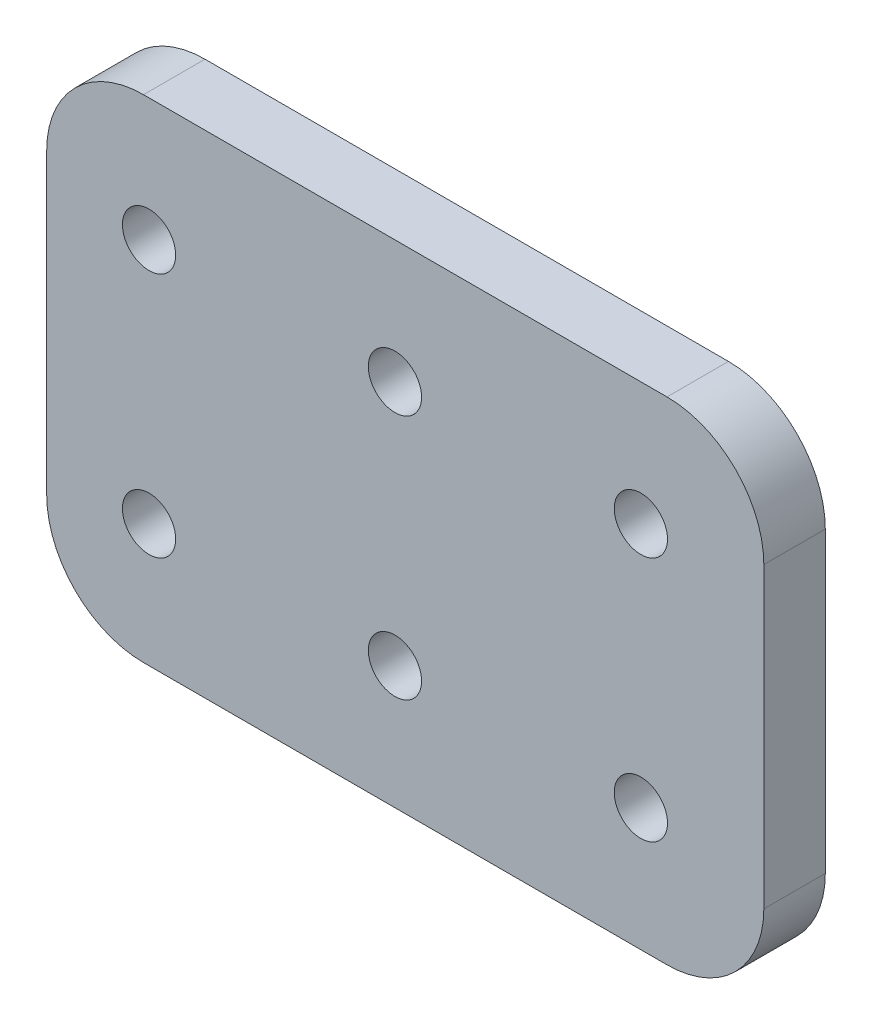
ISO-10303-21;
HEADER;
FILE_DESCRIPTION(('STEP AP214'),'2;1');
FILE_NAME('part.step','',(''),(''),'','','');
FILE_SCHEMA(('AUTOMOTIVE_DESIGN { 1 0 10303 214 1 1 1 1 }'));
ENDSEC;
DATA;
#1=APPLICATION_CONTEXT('core data for automotive mechanical design processes');
#2=APPLICATION_PROTOCOL_DEFINITION('international standard','automotive_design',2000,#1);
#3=PRODUCT_CONTEXT('',#1,'mechanical');
#4=PRODUCT('Part','Part','',(#3));
#5=PRODUCT_RELATED_PRODUCT_CATEGORY('part','',(#4));
#6=PRODUCT_DEFINITION_FORMATION('','',#4);
#7=PRODUCT_DEFINITION_CONTEXT('part definition',#1,'design');
#8=PRODUCT_DEFINITION('design','',#6,#7);
#9=PRODUCT_DEFINITION_SHAPE('','',#8);
#10=(LENGTH_UNIT() NAMED_UNIT(*) SI_UNIT(.MILLI.,.METRE.));
#11=(NAMED_UNIT(*) PLANE_ANGLE_UNIT() SI_UNIT($,.RADIAN.));
#12=(NAMED_UNIT(*) SI_UNIT($,.STERADIAN.) SOLID_ANGLE_UNIT());
#13=UNCERTAINTY_MEASURE_WITH_UNIT(LENGTH_MEASURE(1.E-05),#10,'distance_accuracy_value','');
#14=(GEOMETRIC_REPRESENTATION_CONTEXT(3) GLOBAL_UNCERTAINTY_ASSIGNED_CONTEXT((#13)) GLOBAL_UNIT_ASSIGNED_CONTEXT((#10,
#11,#12)) REPRESENTATION_CONTEXT('',''));
#15=CARTESIAN_POINT('',(0.,0.,0.));
#16=DIRECTION('',(0.,0.,1.));
#17=DIRECTION('',(1.,0.,0.));
#18=AXIS2_PLACEMENT_3D('',#15,#16,#17);
#19=CARTESIAN_POINT('',(-37.035,-25.4,6.35));
#20=DIRECTION('',(1.,0.,0.));
#21=DIRECTION('',(0.,1.,0.));
#22=AXIS2_PLACEMENT_3D('',#19,#20,#21);
#23=PLANE('',#22);
#24=DIRECTION('',(0.,-1.,0.));
#25=VECTOR('',#24,1.);
#26=CARTESIAN_POINT('',(-37.035,-25.4,0.));
#27=LINE('',#26,#25);
#28=CARTESIAN_POINT('',(-37.035,15.4,0.));
#29=VERTEX_POINT('',#28);
#30=CARTESIAN_POINT('',(-37.035,-15.4,0.));
#31=VERTEX_POINT('',#30);
#32=EDGE_CURVE('E125',#29,#31,#27,.T.);
#33=ORIENTED_EDGE('',*,*,#32,.T.);
#34=DIRECTION('',(0.,0.,-1.));
#35=VECTOR('',#34,1.);
#36=CARTESIAN_POINT('',(-37.035,-15.4,6.35));
#37=LINE('',#36,#35);
#38=CARTESIAN_POINT('',(-37.035,-15.4,6.35));
#39=VERTEX_POINT('',#38);
#40=EDGE_CURVE('E103',#31,#39,#37,.F.);
#41=ORIENTED_EDGE('',*,*,#40,.T.);
#42=DIRECTION('',(0.,-1.,0.));
#43=VECTOR('',#42,1.);
#44=CARTESIAN_POINT('',(-37.035,-25.4,6.35));
#45=LINE('',#44,#43);
#46=CARTESIAN_POINT('',(-37.035,15.4,6.35));
#47=VERTEX_POINT('',#46);
#48=EDGE_CURVE('E135',#47,#39,#45,.T.);
#49=ORIENTED_EDGE('',*,*,#48,.F.);
#50=DIRECTION('',(0.,0.,-1.));
#51=VECTOR('',#50,1.);
#52=CARTESIAN_POINT('',(-37.035,15.4,6.35));
#53=LINE('',#52,#51);
#54=EDGE_CURVE('E108',#47,#29,#53,.T.);
#55=ORIENTED_EDGE('',*,*,#54,.T.);
#56=EDGE_LOOP('',(#33,#41,#49,#55));
#57=FACE_BOUND('',#56,.T.);
#58=ADVANCED_FACE('F32',(#57),#23,.F.);
#59=CARTESIAN_POINT('',(37.035,-25.4,6.35));
#60=DIRECTION('',(0.,1.,0.));
#61=DIRECTION('',(0.,0.,1.));
#62=AXIS2_PLACEMENT_3D('',#59,#60,#61);
#63=PLANE('',#62);
#64=DIRECTION('',(1.,0.,0.));
#65=VECTOR('',#64,1.);
#66=CARTESIAN_POINT('',(37.035,-25.4,6.35));
#67=LINE('',#66,#65);
#68=CARTESIAN_POINT('',(-27.035,-25.4,6.35));
#69=VERTEX_POINT('',#68);
#70=CARTESIAN_POINT('',(27.035,-25.4,6.35));
#71=VERTEX_POINT('',#70);
#72=EDGE_CURVE('E118',#69,#71,#67,.T.);
#73=ORIENTED_EDGE('',*,*,#72,.F.);
#74=DIRECTION('',(0.,0.,-1.));
#75=VECTOR('',#74,1.);
#76=CARTESIAN_POINT('',(-27.035,-25.4,6.35));
#77=LINE('',#76,#75);
#78=CARTESIAN_POINT('',(-27.035,-25.4,0.));
#79=VERTEX_POINT('',#78);
#80=EDGE_CURVE('E102',#69,#79,#77,.T.);
#81=ORIENTED_EDGE('',*,*,#80,.T.);
#82=DIRECTION('',(1.,0.,0.));
#83=VECTOR('',#82,1.);
#84=CARTESIAN_POINT('',(37.035,-25.4,0.));
#85=LINE('',#84,#83);
#86=CARTESIAN_POINT('',(27.035,-25.4,0.));
#87=VERTEX_POINT('',#86);
#88=EDGE_CURVE('E115',#79,#87,#85,.T.);
#89=ORIENTED_EDGE('',*,*,#88,.T.);
#90=DIRECTION('',(0.,0.,-1.));
#91=VECTOR('',#90,1.);
#92=CARTESIAN_POINT('',(27.035,-25.4,6.35));
#93=LINE('',#92,#91);
#94=EDGE_CURVE('E120',#87,#71,#93,.F.);
#95=ORIENTED_EDGE('',*,*,#94,.T.);
#96=EDGE_LOOP('',(#73,#81,#89,#95));
#97=FACE_BOUND('',#96,.T.);
#98=ADVANCED_FACE('F114',(#97),#63,.F.);
#99=CARTESIAN_POINT('',(37.035,-25.4,6.35));
#100=DIRECTION('',(-1.,0.,0.));
#101=DIRECTION('',(0.,-1.,0.));
#102=AXIS2_PLACEMENT_3D('',#99,#100,#101);
#103=PLANE('',#102);
#104=DIRECTION('',(0.,1.,0.));
#105=VECTOR('',#104,1.);
#106=CARTESIAN_POINT('',(37.035,-25.4,6.35));
#107=LINE('',#106,#105);
#108=CARTESIAN_POINT('',(37.035,-15.4,6.35));
#109=VERTEX_POINT('',#108);
#110=CARTESIAN_POINT('',(37.035,15.4,6.35));
#111=VERTEX_POINT('',#110);
#112=EDGE_CURVE('E161',#109,#111,#107,.T.);
#113=ORIENTED_EDGE('',*,*,#112,.F.);
#114=DIRECTION('',(0.,0.,-1.));
#115=VECTOR('',#114,1.);
#116=CARTESIAN_POINT('',(37.035,-15.4,6.35));
#117=LINE('',#116,#115);
#118=CARTESIAN_POINT('',(37.035,-15.4,0.));
#119=VERTEX_POINT('',#118);
#120=EDGE_CURVE('E154',#109,#119,#117,.T.);
#121=ORIENTED_EDGE('',*,*,#120,.T.);
#122=DIRECTION('',(0.,1.,0.));
#123=VECTOR('',#122,1.);
#124=CARTESIAN_POINT('',(37.035,-25.4,0.));
#125=LINE('',#124,#123);
#126=CARTESIAN_POINT('',(37.035,15.4,0.));
#127=VERTEX_POINT('',#126);
#128=EDGE_CURVE('E124',#119,#127,#125,.T.);
#129=ORIENTED_EDGE('',*,*,#128,.T.);
#130=DIRECTION('',(0.,0.,-1.));
#131=VECTOR('',#130,1.);
#132=CARTESIAN_POINT('',(37.035,15.4,6.35));
#133=LINE('',#132,#131);
#134=EDGE_CURVE('E152',#127,#111,#133,.F.);
#135=ORIENTED_EDGE('',*,*,#134,.T.);
#136=EDGE_LOOP('',(#113,#121,#129,#135));
#137=FACE_BOUND('',#136,.T.);
#138=ADVANCED_FACE('F159',(#137),#103,.F.);
#139=CARTESIAN_POINT('',(37.035,25.4,6.35));
#140=DIRECTION('',(0.,-1.,0.));
#141=DIRECTION('',(1.,0.,0.));
#142=AXIS2_PLACEMENT_3D('',#139,#140,#141);
#143=PLANE('',#142);
#144=DIRECTION('',(-1.,0.,0.));
#145=VECTOR('',#144,1.);
#146=CARTESIAN_POINT('',(37.035,25.4,6.35));
#147=LINE('',#146,#145);
#148=CARTESIAN_POINT('',(27.035,25.4,6.35));
#149=VERTEX_POINT('',#148);
#150=CARTESIAN_POINT('',(-27.035,25.4,6.35));
#151=VERTEX_POINT('',#150);
#152=EDGE_CURVE('E136',#149,#151,#147,.T.);
#153=ORIENTED_EDGE('',*,*,#152,.F.);
#154=DIRECTION('',(0.,0.,-1.));
#155=VECTOR('',#154,1.);
#156=CARTESIAN_POINT('',(27.035,25.4,6.35));
#157=LINE('',#156,#155);
#158=CARTESIAN_POINT('',(27.035,25.4,0.));
#159=VERTEX_POINT('',#158);
#160=EDGE_CURVE('E11',#149,#159,#157,.T.);
#161=ORIENTED_EDGE('',*,*,#160,.T.);
#162=DIRECTION('',(-1.,0.,0.));
#163=VECTOR('',#162,1.);
#164=CARTESIAN_POINT('',(37.035,25.4,0.));
#165=LINE('',#164,#163);
#166=CARTESIAN_POINT('',(-27.035,25.4,0.));
#167=VERTEX_POINT('',#166);
#168=EDGE_CURVE('E128',#159,#167,#165,.T.);
#169=ORIENTED_EDGE('',*,*,#168,.T.);
#170=DIRECTION('',(0.,0.,-1.));
#171=VECTOR('',#170,1.);
#172=CARTESIAN_POINT('',(-27.035,25.4,6.35));
#173=LINE('',#172,#171);
#174=EDGE_CURVE('E40',#167,#151,#173,.F.);
#175=ORIENTED_EDGE('',*,*,#174,.T.);
#176=EDGE_LOOP('',(#153,#161,#169,#175));
#177=FACE_BOUND('',#176,.T.);
#178=ADVANCED_FACE('F168',(#177),#143,.F.);
#179=CARTESIAN_POINT('',(0.,0.,6.35));
#180=DIRECTION('',(0.,0.,1.));
#181=DIRECTION('',(1.,0.,0.));
#182=AXIS2_PLACEMENT_3D('',#179,#180,#181);
#183=PLANE('',#182);
#184=CARTESIAN_POINT('',(-26.465,12.7,6.35));
#185=DIRECTION('',(0.,0.,1.));
#186=DIRECTION('',(1.,0.,0.));
#187=AXIS2_PLACEMENT_3D('',#184,#185,#186);
#188=CIRCLE('',#187,2.74999999999999);
#189=CARTESIAN_POINT('',(-23.715,12.7,6.35));
#190=VERTEX_POINT('',#189);
#191=EDGE_CURVE('E207',#190,#190,#188,.T.);
#192=ORIENTED_EDGE('',*,*,#191,.F.);
#193=EDGE_LOOP('',(#192));
#194=FACE_BOUND('',#193,.T.);
#195=CARTESIAN_POINT('',(-26.465,-12.7,6.35));
#196=DIRECTION('',(0.,0.,1.));
#197=DIRECTION('',(1.,0.,0.));
#198=AXIS2_PLACEMENT_3D('',#195,#196,#197);
#199=CIRCLE('',#198,2.74999999999999);
#200=CARTESIAN_POINT('',(-23.715,-12.7,6.35));
#201=VERTEX_POINT('',#200);
#202=EDGE_CURVE('E201',#201,#201,#199,.T.);
#203=ORIENTED_EDGE('',*,*,#202,.F.);
#204=EDGE_LOOP('',(#203));
#205=FACE_BOUND('',#204,.T.);
#206=CARTESIAN_POINT('',(-1.06499999999997,-12.7,6.35));
#207=DIRECTION('',(0.,0.,1.));
#208=DIRECTION('',(1.,0.,0.));
#209=AXIS2_PLACEMENT_3D('',#206,#207,#208);
#210=CIRCLE('',#209,2.74999999999999);
#211=CARTESIAN_POINT('',(1.68500000000001,-12.7,6.35));
#212=VERTEX_POINT('',#211);
#213=EDGE_CURVE('E195',#212,#212,#210,.T.);
#214=ORIENTED_EDGE('',*,*,#213,.F.);
#215=EDGE_LOOP('',(#214));
#216=FACE_BOUND('',#215,.T.);
#217=CARTESIAN_POINT('',(-1.06499999999998,12.7,6.35));
#218=DIRECTION('',(0.,0.,1.));
#219=DIRECTION('',(1.,0.,0.));
#220=AXIS2_PLACEMENT_3D('',#217,#218,#219);
#221=CIRCLE('',#220,2.74999999999999);
#222=CARTESIAN_POINT('',(1.68500000000001,12.7,6.35));
#223=VERTEX_POINT('',#222);
#224=EDGE_CURVE('E189',#223,#223,#221,.T.);
#225=ORIENTED_EDGE('',*,*,#224,.F.);
#226=EDGE_LOOP('',(#225));
#227=FACE_BOUND('',#226,.T.);
#228=CARTESIAN_POINT('',(24.335,12.7,6.35));
#229=DIRECTION('',(0.,0.,1.));
#230=DIRECTION('',(1.,0.,0.));
#231=AXIS2_PLACEMENT_3D('',#228,#229,#230);
#232=CIRCLE('',#231,2.74999999999999);
#233=CARTESIAN_POINT('',(27.085,12.7,6.35));
#234=VERTEX_POINT('',#233);
#235=EDGE_CURVE('E183',#234,#234,#232,.T.);
#236=ORIENTED_EDGE('',*,*,#235,.F.);
#237=EDGE_LOOP('',(#236));
#238=FACE_BOUND('',#237,.T.);
#239=CARTESIAN_POINT('',(24.335,-12.7,6.35));
#240=DIRECTION('',(0.,0.,1.));
#241=DIRECTION('',(1.,0.,0.));
#242=AXIS2_PLACEMENT_3D('',#239,#240,#241);
#243=CIRCLE('',#242,2.74999999999999);
#244=CARTESIAN_POINT('',(27.085,-12.7,6.35));
#245=VERTEX_POINT('',#244);
#246=EDGE_CURVE('E177',#245,#245,#243,.T.);
#247=ORIENTED_EDGE('',*,*,#246,.F.);
#248=EDGE_LOOP('',(#247));
#249=FACE_BOUND('',#248,.T.);
#250=ORIENTED_EDGE('',*,*,#48,.T.);
#251=CARTESIAN_POINT('',(-27.035,-15.4,6.35));
#252=DIRECTION('',(0.,0.,1.));
#253=DIRECTION('',(1.,0.,0.));
#254=AXIS2_PLACEMENT_3D('',#251,#252,#253);
#255=CIRCLE('',#254,10.);
#256=EDGE_CURVE('E150',#39,#69,#255,.T.);
#257=ORIENTED_EDGE('',*,*,#256,.T.);
#258=ORIENTED_EDGE('',*,*,#72,.T.);
#259=CARTESIAN_POINT('',(27.035,-15.4,6.35));
#260=DIRECTION('',(0.,0.,1.));
#261=DIRECTION('',(1.,0.,0.));
#262=AXIS2_PLACEMENT_3D('',#259,#260,#261);
#263=CIRCLE('',#262,10.);
#264=EDGE_CURVE('E148',#71,#109,#263,.T.);
#265=ORIENTED_EDGE('',*,*,#264,.T.);
#266=ORIENTED_EDGE('',*,*,#112,.T.);
#267=CARTESIAN_POINT('',(27.035,15.4,6.35));
#268=DIRECTION('',(0.,0.,1.));
#269=DIRECTION('',(1.,0.,0.));
#270=AXIS2_PLACEMENT_3D('',#267,#268,#269);
#271=CIRCLE('',#270,10.);
#272=EDGE_CURVE('E53',#111,#149,#271,.T.);
#273=ORIENTED_EDGE('',*,*,#272,.T.);
#274=ORIENTED_EDGE('',*,*,#152,.T.);
#275=CARTESIAN_POINT('',(-27.035,15.4,6.35));
#276=DIRECTION('',(0.,0.,1.));
#277=DIRECTION('',(1.,0.,0.));
#278=AXIS2_PLACEMENT_3D('',#275,#276,#277);
#279=CIRCLE('',#278,10.);
#280=EDGE_CURVE('E145',#151,#47,#279,.T.);
#281=ORIENTED_EDGE('',*,*,#280,.T.);
#282=EDGE_LOOP('',(#250,#257,#258,#265,#266,#273,#274,#281));
#283=FACE_BOUND('',#282,.T.);
#284=ADVANCED_FACE('F213',(#194,#205,#216,#227,#238,#249,#283),#183,.T.);
#285=CARTESIAN_POINT('',(0.,0.,0.));
#286=DIRECTION('',(0.,0.,1.));
#287=DIRECTION('',(1.,0.,0.));
#288=AXIS2_PLACEMENT_3D('',#285,#286,#287);
#289=PLANE('',#288);
#290=CARTESIAN_POINT('',(-26.465,12.7,0.));
#291=DIRECTION('',(0.,0.,1.));
#292=DIRECTION('',(1.,0.,0.));
#293=AXIS2_PLACEMENT_3D('',#290,#291,#292);
#294=CIRCLE('',#293,2.75);
#295=CARTESIAN_POINT('',(-23.715,12.7,0.));
#296=VERTEX_POINT('',#295);
#297=EDGE_CURVE('E204',#296,#296,#294,.T.);
#298=ORIENTED_EDGE('',*,*,#297,.T.);
#299=EDGE_LOOP('',(#298));
#300=FACE_BOUND('',#299,.T.);
#301=CARTESIAN_POINT('',(-26.465,-12.7,0.));
#302=DIRECTION('',(0.,0.,1.));
#303=DIRECTION('',(1.,0.,0.));
#304=AXIS2_PLACEMENT_3D('',#301,#302,#303);
#305=CIRCLE('',#304,2.75);
#306=CARTESIAN_POINT('',(-23.715,-12.7,0.));
#307=VERTEX_POINT('',#306);
#308=EDGE_CURVE('E198',#307,#307,#305,.T.);
#309=ORIENTED_EDGE('',*,*,#308,.T.);
#310=EDGE_LOOP('',(#309));
#311=FACE_BOUND('',#310,.T.);
#312=CARTESIAN_POINT('',(-1.06499999999997,-12.7,0.));
#313=DIRECTION('',(0.,0.,1.));
#314=DIRECTION('',(1.,0.,0.));
#315=AXIS2_PLACEMENT_3D('',#312,#313,#314);
#316=CIRCLE('',#315,2.75);
#317=CARTESIAN_POINT('',(1.68500000000002,-12.7,0.));
#318=VERTEX_POINT('',#317);
#319=EDGE_CURVE('E192',#318,#318,#316,.T.);
#320=ORIENTED_EDGE('',*,*,#319,.T.);
#321=EDGE_LOOP('',(#320));
#322=FACE_BOUND('',#321,.T.);
#323=CARTESIAN_POINT('',(-1.06499999999998,12.7,0.));
#324=DIRECTION('',(0.,0.,1.));
#325=DIRECTION('',(1.,0.,0.));
#326=AXIS2_PLACEMENT_3D('',#323,#324,#325);
#327=CIRCLE('',#326,2.75);
#328=CARTESIAN_POINT('',(1.68500000000002,12.7,0.));
#329=VERTEX_POINT('',#328);
#330=EDGE_CURVE('E186',#329,#329,#327,.T.);
#331=ORIENTED_EDGE('',*,*,#330,.T.);
#332=EDGE_LOOP('',(#331));
#333=FACE_BOUND('',#332,.T.);
#334=CARTESIAN_POINT('',(24.335,12.7,0.));
#335=DIRECTION('',(0.,0.,1.));
#336=DIRECTION('',(1.,0.,0.));
#337=AXIS2_PLACEMENT_3D('',#334,#335,#336);
#338=CIRCLE('',#337,2.75);
#339=CARTESIAN_POINT('',(27.085,12.7,0.));
#340=VERTEX_POINT('',#339);
#341=EDGE_CURVE('E180',#340,#340,#338,.T.);
#342=ORIENTED_EDGE('',*,*,#341,.T.);
#343=EDGE_LOOP('',(#342));
#344=FACE_BOUND('',#343,.T.);
#345=CARTESIAN_POINT('',(24.335,-12.7,0.));
#346=DIRECTION('',(0.,0.,1.));
#347=DIRECTION('',(1.,0.,0.));
#348=AXIS2_PLACEMENT_3D('',#345,#346,#347);
#349=CIRCLE('',#348,2.75);
#350=CARTESIAN_POINT('',(27.085,-12.7,0.));
#351=VERTEX_POINT('',#350);
#352=EDGE_CURVE('E130',#351,#351,#349,.T.);
#353=ORIENTED_EDGE('',*,*,#352,.T.);
#354=EDGE_LOOP('',(#353));
#355=FACE_BOUND('',#354,.T.);
#356=ORIENTED_EDGE('',*,*,#88,.F.);
#357=CARTESIAN_POINT('',(-27.035,-15.4,0.));
#358=DIRECTION('',(0.,0.,1.));
#359=DIRECTION('',(1.,0.,0.));
#360=AXIS2_PLACEMENT_3D('',#357,#358,#359);
#361=CIRCLE('',#360,10.);
#362=EDGE_CURVE('E98',#79,#31,#361,.F.);
#363=ORIENTED_EDGE('',*,*,#362,.T.);
#364=ORIENTED_EDGE('',*,*,#32,.F.);
#365=CARTESIAN_POINT('',(-27.035,15.4,0.));
#366=DIRECTION('',(0.,0.,1.));
#367=DIRECTION('',(1.,0.,0.));
#368=AXIS2_PLACEMENT_3D('',#365,#366,#367);
#369=CIRCLE('',#368,10.);
#370=EDGE_CURVE('E119',#29,#167,#369,.F.);
#371=ORIENTED_EDGE('',*,*,#370,.T.);
#372=ORIENTED_EDGE('',*,*,#168,.F.);
#373=CARTESIAN_POINT('',(27.035,15.4,0.));
#374=DIRECTION('',(0.,0.,1.));
#375=DIRECTION('',(1.,0.,0.));
#376=AXIS2_PLACEMENT_3D('',#373,#374,#375);
#377=CIRCLE('',#376,10.);
#378=EDGE_CURVE('E139',#159,#127,#377,.F.);
#379=ORIENTED_EDGE('',*,*,#378,.T.);
#380=ORIENTED_EDGE('',*,*,#128,.F.);
#381=CARTESIAN_POINT('',(27.035,-15.4,0.));
#382=DIRECTION('',(0.,0.,1.));
#383=DIRECTION('',(1.,0.,0.));
#384=AXIS2_PLACEMENT_3D('',#381,#382,#383);
#385=CIRCLE('',#384,10.);
#386=EDGE_CURVE('E109',#119,#87,#385,.F.);
#387=ORIENTED_EDGE('',*,*,#386,.T.);
#388=EDGE_LOOP('',(#356,#363,#364,#371,#372,#379,#380,#387));
#389=FACE_BOUND('',#388,.T.);
#390=ADVANCED_FACE('F122',(#300,#311,#322,#333,#344,#355,#389),#289,.F.);
#391=CARTESIAN_POINT('',(-27.035,-15.4,6.35));
#392=DIRECTION('',(0.,0.,-1.));
#393=DIRECTION('',(-1.,0.,0.));
#394=AXIS2_PLACEMENT_3D('',#391,#392,#393);
#395=CYLINDRICAL_SURFACE('',#394,10.);
#396=ORIENTED_EDGE('',*,*,#256,.F.);
#397=ORIENTED_EDGE('',*,*,#40,.F.);
#398=ORIENTED_EDGE('',*,*,#362,.F.);
#399=ORIENTED_EDGE('',*,*,#80,.F.);
#400=EDGE_LOOP('',(#396,#397,#398,#399));
#401=FACE_BOUND('',#400,.T.);
#402=ADVANCED_FACE('F101',(#401),#395,.T.);
#403=CARTESIAN_POINT('',(27.035,-15.4,6.35));
#404=DIRECTION('',(0.,0.,-1.));
#405=DIRECTION('',(-1.,0.,0.));
#406=AXIS2_PLACEMENT_3D('',#403,#404,#405);
#407=CYLINDRICAL_SURFACE('',#406,10.);
#408=ORIENTED_EDGE('',*,*,#264,.F.);
#409=ORIENTED_EDGE('',*,*,#94,.F.);
#410=ORIENTED_EDGE('',*,*,#386,.F.);
#411=ORIENTED_EDGE('',*,*,#120,.F.);
#412=EDGE_LOOP('',(#408,#409,#410,#411));
#413=FACE_BOUND('',#412,.T.);
#414=ADVANCED_FACE('F239',(#413),#407,.T.);
#415=CARTESIAN_POINT('',(27.035,15.4,6.35));
#416=DIRECTION('',(0.,0.,-1.));
#417=DIRECTION('',(-1.,0.,0.));
#418=AXIS2_PLACEMENT_3D('',#415,#416,#417);
#419=CYLINDRICAL_SURFACE('',#418,10.);
#420=ORIENTED_EDGE('',*,*,#272,.F.);
#421=ORIENTED_EDGE('',*,*,#134,.F.);
#422=ORIENTED_EDGE('',*,*,#378,.F.);
#423=ORIENTED_EDGE('',*,*,#160,.F.);
#424=EDGE_LOOP('',(#420,#421,#422,#423));
#425=FACE_BOUND('',#424,.T.);
#426=ADVANCED_FACE('F167',(#425),#419,.T.);
#427=CARTESIAN_POINT('',(-27.035,15.4,6.35));
#428=DIRECTION('',(0.,0.,-1.));
#429=DIRECTION('',(-1.,0.,0.));
#430=AXIS2_PLACEMENT_3D('',#427,#428,#429);
#431=CYLINDRICAL_SURFACE('',#430,10.);
#432=ORIENTED_EDGE('',*,*,#280,.F.);
#433=ORIENTED_EDGE('',*,*,#174,.F.);
#434=ORIENTED_EDGE('',*,*,#370,.F.);
#435=ORIENTED_EDGE('',*,*,#54,.F.);
#436=EDGE_LOOP('',(#432,#433,#434,#435));
#437=FACE_BOUND('',#436,.T.);
#438=ADVANCED_FACE('F34',(#437),#431,.T.);
#439=CARTESIAN_POINT('',(24.335,-12.7,6.35));
#440=DIRECTION('',(0.,0.,1.));
#441=DIRECTION('',(1.,0.,0.));
#442=AXIS2_PLACEMENT_3D('',#439,#440,#441);
#443=CYLINDRICAL_SURFACE('',#442,2.74999999999999);
#444=ORIENTED_EDGE('',*,*,#352,.F.);
#445=EDGE_LOOP('',(#444));
#446=FACE_BOUND('',#445,.T.);
#447=ORIENTED_EDGE('',*,*,#246,.T.);
#448=EDGE_LOOP('',(#447));
#449=FACE_BOUND('',#448,.T.);
#450=ADVANCED_FACE('F231',(#446,#449),#443,.F.);
#451=CARTESIAN_POINT('',(24.335,12.7,6.35));
#452=DIRECTION('',(0.,0.,1.));
#453=DIRECTION('',(1.,0.,0.));
#454=AXIS2_PLACEMENT_3D('',#451,#452,#453);
#455=CYLINDRICAL_SURFACE('',#454,2.74999999999999);
#456=ORIENTED_EDGE('',*,*,#341,.F.);
#457=EDGE_LOOP('',(#456));
#458=FACE_BOUND('',#457,.T.);
#459=ORIENTED_EDGE('',*,*,#235,.T.);
#460=EDGE_LOOP('',(#459));
#461=FACE_BOUND('',#460,.T.);
#462=ADVANCED_FACE('F236',(#458,#461),#455,.F.);
#463=CARTESIAN_POINT('',(-1.06499999999998,12.7,6.35));
#464=DIRECTION('',(0.,0.,1.));
#465=DIRECTION('',(1.,0.,0.));
#466=AXIS2_PLACEMENT_3D('',#463,#464,#465);
#467=CYLINDRICAL_SURFACE('',#466,2.74999999999999);
#468=ORIENTED_EDGE('',*,*,#330,.F.);
#469=EDGE_LOOP('',(#468));
#470=FACE_BOUND('',#469,.T.);
#471=ORIENTED_EDGE('',*,*,#224,.T.);
#472=EDGE_LOOP('',(#471));
#473=FACE_BOUND('',#472,.T.);
#474=ADVANCED_FACE('F296',(#470,#473),#467,.F.);
#475=CARTESIAN_POINT('',(-1.06499999999997,-12.7,6.35));
#476=DIRECTION('',(0.,0.,1.));
#477=DIRECTION('',(1.,0.,0.));
#478=AXIS2_PLACEMENT_3D('',#475,#476,#477);
#479=CYLINDRICAL_SURFACE('',#478,2.74999999999999);
#480=ORIENTED_EDGE('',*,*,#319,.F.);
#481=EDGE_LOOP('',(#480));
#482=FACE_BOUND('',#481,.T.);
#483=ORIENTED_EDGE('',*,*,#213,.T.);
#484=EDGE_LOOP('',(#483));
#485=FACE_BOUND('',#484,.T.);
#486=ADVANCED_FACE('F306',(#482,#485),#479,.F.);
#487=CARTESIAN_POINT('',(-26.465,-12.7,6.35));
#488=DIRECTION('',(0.,0.,1.));
#489=DIRECTION('',(1.,0.,0.));
#490=AXIS2_PLACEMENT_3D('',#487,#488,#489);
#491=CYLINDRICAL_SURFACE('',#490,2.74999999999999);
#492=ORIENTED_EDGE('',*,*,#308,.F.);
#493=EDGE_LOOP('',(#492));
#494=FACE_BOUND('',#493,.T.);
#495=ORIENTED_EDGE('',*,*,#202,.T.);
#496=EDGE_LOOP('',(#495));
#497=FACE_BOUND('',#496,.T.);
#498=ADVANCED_FACE('F316',(#494,#497),#491,.F.);
#499=CARTESIAN_POINT('',(-26.465,12.7,6.35));
#500=DIRECTION('',(0.,0.,1.));
#501=DIRECTION('',(1.,0.,0.));
#502=AXIS2_PLACEMENT_3D('',#499,#500,#501);
#503=CYLINDRICAL_SURFACE('',#502,2.74999999999999);
#504=ORIENTED_EDGE('',*,*,#297,.F.);
#505=EDGE_LOOP('',(#504));
#506=FACE_BOUND('',#505,.T.);
#507=ORIENTED_EDGE('',*,*,#191,.T.);
#508=EDGE_LOOP('',(#507));
#509=FACE_BOUND('',#508,.T.);
#510=ADVANCED_FACE('F211',(#506,#509),#503,.F.);
#511=CLOSED_SHELL('',(#58,#98,#138,#178,#284,#390,#402,#414,#426,#438,#450,#462,#474,#486,#498,#510));
#512=MANIFOLD_SOLID_BREP('B2',#511);
#513=ADVANCED_BREP_SHAPE_REPRESENTATION('',(#18,#512),#14);
#514=SHAPE_DEFINITION_REPRESENTATION(#9,#513);
ENDSEC;
END-ISO-10303-21;
